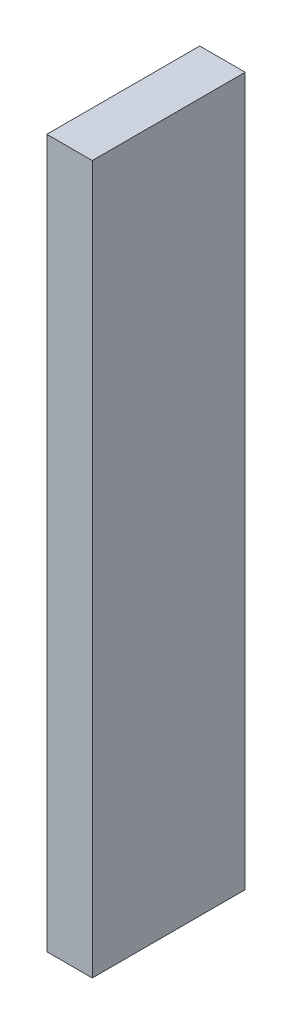
ISO-10303-21;
HEADER;
FILE_DESCRIPTION(('STEP AP214'),'2;1');
FILE_NAME('part.step','',(''),(''),'','','');
FILE_SCHEMA(('AUTOMOTIVE_DESIGN { 1 0 10303 214 1 1 1 1 }'));
ENDSEC;
DATA;
#1=APPLICATION_CONTEXT('core data for automotive mechanical design processes');
#2=APPLICATION_PROTOCOL_DEFINITION('international standard','automotive_design',2000,#1);
#3=PRODUCT_CONTEXT('',#1,'mechanical');
#4=PRODUCT('Part','Part','',(#3));
#5=PRODUCT_RELATED_PRODUCT_CATEGORY('part','',(#4));
#6=PRODUCT_DEFINITION_FORMATION('','',#4);
#7=PRODUCT_DEFINITION_CONTEXT('part definition',#1,'design');
#8=PRODUCT_DEFINITION('design','',#6,#7);
#9=PRODUCT_DEFINITION_SHAPE('','',#8);
#10=(LENGTH_UNIT() NAMED_UNIT(*) SI_UNIT(.MILLI.,.METRE.));
#11=(NAMED_UNIT(*) PLANE_ANGLE_UNIT() SI_UNIT($,.RADIAN.));
#12=(NAMED_UNIT(*) SI_UNIT($,.STERADIAN.) SOLID_ANGLE_UNIT());
#13=UNCERTAINTY_MEASURE_WITH_UNIT(LENGTH_MEASURE(1.E-05),#10,'distance_accuracy_value','');
#14=(GEOMETRIC_REPRESENTATION_CONTEXT(3) GLOBAL_UNCERTAINTY_ASSIGNED_CONTEXT((#13)) GLOBAL_UNIT_ASSIGNED_CONTEXT((#10,
#11,#12)) REPRESENTATION_CONTEXT('',''));
#15=CARTESIAN_POINT('',(0.,0.,0.));
#16=DIRECTION('',(0.,0.,1.));
#17=DIRECTION('',(1.,0.,0.));
#18=AXIS2_PLACEMENT_3D('',#15,#16,#17);
#19=CARTESIAN_POINT('',(130.275545204017,22.4180708263693,91.0720282028969));
#20=DIRECTION('',(-1.69244514382854E-09,0.,1.));
#21=DIRECTION('',(1.,0.,1.69244514382854E-09));
#22=AXIS2_PLACEMENT_3D('',#19,#20,#21);
#23=PLANE('',#22);
#24=DIRECTION('',(0.,-1.,0.));
#25=VECTOR('',#24,1.);
#26=CARTESIAN_POINT('',(131.25863030103,22.4180708263693,91.0720282045608));
#27=LINE('',#26,#25);
#28=CARTESIAN_POINT('',(131.25863030103,22.4180708263693,91.0720282045608));
#29=VERTEX_POINT('',#28);
#30=CARTESIAN_POINT('',(131.25863030103,7.11212965552236,91.0720282045608));
#31=VERTEX_POINT('',#30);
#32=EDGE_CURVE('E79',#29,#31,#27,.T.);
#33=ORIENTED_EDGE('',*,*,#32,.F.);
#34=DIRECTION('',(1.,0.,1.69244514382854E-09));
#35=VECTOR('',#34,1.);
#36=CARTESIAN_POINT('',(130.275545204017,22.4180708263693,91.0720282028969));
#37=LINE('',#36,#35);
#38=CARTESIAN_POINT('',(130.275545204017,22.4180708263693,91.0720282028969));
#39=VERTEX_POINT('',#38);
#40=EDGE_CURVE('E32',#39,#29,#37,.T.);
#41=ORIENTED_EDGE('',*,*,#40,.F.);
#42=DIRECTION('',(0.,-1.,0.));
#43=VECTOR('',#42,1.);
#44=CARTESIAN_POINT('',(130.275545204017,22.4180708263693,91.0720282028969));
#45=LINE('',#44,#43);
#46=CARTESIAN_POINT('',(130.275545204017,7.11212965552236,91.0720282028969));
#47=VERTEX_POINT('',#46);
#48=EDGE_CURVE('E71',#39,#47,#45,.T.);
#49=ORIENTED_EDGE('',*,*,#48,.T.);
#50=DIRECTION('',(1.,0.,1.69244514382854E-09));
#51=VECTOR('',#50,1.);
#52=CARTESIAN_POINT('',(130.275545204017,7.11212965552236,91.0720282028969));
#53=LINE('',#52,#51);
#54=EDGE_CURVE('E10',#47,#31,#53,.T.);
#55=ORIENTED_EDGE('',*,*,#54,.T.);
#56=EDGE_LOOP('',(#33,#41,#49,#55));
#57=FACE_BOUND('',#56,.T.);
#58=ADVANCED_FACE('F16',(#57),#23,.T.);
#59=CARTESIAN_POINT('',(130.275545204017,7.11212965552236,91.0720282028969));
#60=DIRECTION('',(0.,-1.,0.));
#61=DIRECTION('',(0.,0.,-1.));
#62=AXIS2_PLACEMENT_3D('',#59,#60,#61);
#63=PLANE('',#62);
#64=DIRECTION('',(1.69244514382854E-09,0.,-1.));
#65=VECTOR('',#64,1.);
#66=CARTESIAN_POINT('',(131.25863030103,7.11212965552236,91.0720282045608));
#67=LINE('',#66,#65);
#68=CARTESIAN_POINT('',(131.258630306625,7.11212965552235,87.766087033712));
#69=VERTEX_POINT('',#68);
#70=EDGE_CURVE('E82',#31,#69,#67,.T.);
#71=ORIENTED_EDGE('',*,*,#70,.F.);
#72=ORIENTED_EDGE('',*,*,#54,.F.);
#73=DIRECTION('',(1.69244514382854E-09,0.,-1.));
#74=VECTOR('',#73,1.);
#75=CARTESIAN_POINT('',(130.275545204017,7.11212965552236,91.0720282028969));
#76=LINE('',#75,#74);
#77=CARTESIAN_POINT('',(130.275545209612,7.11212965552235,87.7660870320482));
#78=VERTEX_POINT('',#77);
#79=EDGE_CURVE('E67',#47,#78,#76,.T.);
#80=ORIENTED_EDGE('',*,*,#79,.T.);
#81=DIRECTION('',(1.,0.,1.69244514382854E-09));
#82=VECTOR('',#81,1.);
#83=CARTESIAN_POINT('',(130.275545209612,7.11212965552235,87.7660870320482));
#84=LINE('',#83,#82);
#85=EDGE_CURVE('E24',#78,#69,#84,.T.);
#86=ORIENTED_EDGE('',*,*,#85,.T.);
#87=EDGE_LOOP('',(#71,#72,#80,#86));
#88=FACE_BOUND('',#87,.T.);
#89=ADVANCED_FACE('F68',(#88),#63,.T.);
#90=CARTESIAN_POINT('',(130.275545209612,7.11212965552235,87.7660870320482));
#91=DIRECTION('',(1.69244514382854E-09,0.,-1.));
#92=DIRECTION('',(-1.,0.,-1.69244514382854E-09));
#93=AXIS2_PLACEMENT_3D('',#90,#91,#92);
#94=PLANE('',#93);
#95=DIRECTION('',(0.,1.,0.));
#96=VECTOR('',#95,1.);
#97=CARTESIAN_POINT('',(131.258630306625,7.11212965552235,87.766087033712));
#98=LINE('',#97,#96);
#99=CARTESIAN_POINT('',(131.258630306625,22.418070826371,87.7660870252515));
#100=VERTEX_POINT('',#99);
#101=EDGE_CURVE('E65',#69,#100,#98,.T.);
#102=ORIENTED_EDGE('',*,*,#101,.F.);
#103=ORIENTED_EDGE('',*,*,#85,.F.);
#104=DIRECTION('',(0.,1.,0.));
#105=VECTOR('',#104,1.);
#106=CARTESIAN_POINT('',(130.275545209612,7.11212965552235,87.7660870320482));
#107=LINE('',#106,#105);
#108=CARTESIAN_POINT('',(130.275545209612,22.418070826371,87.7660870235877));
#109=VERTEX_POINT('',#108);
#110=EDGE_CURVE('E62',#78,#109,#107,.T.);
#111=ORIENTED_EDGE('',*,*,#110,.T.);
#112=DIRECTION('',(1.,0.,1.69244514382854E-09));
#113=VECTOR('',#112,1.);
#114=CARTESIAN_POINT('',(130.275545209612,22.418070826371,87.7660870235877));
#115=LINE('',#114,#113);
#116=EDGE_CURVE('E48',#109,#100,#115,.T.);
#117=ORIENTED_EDGE('',*,*,#116,.T.);
#118=EDGE_LOOP('',(#102,#103,#111,#117));
#119=FACE_BOUND('',#118,.T.);
#120=ADVANCED_FACE('F60',(#119),#94,.T.);
#121=CARTESIAN_POINT('',(130.275545209612,22.418070826371,87.7660870235877));
#122=DIRECTION('',(0.,1.,0.));
#123=DIRECTION('',(-1.,0.,0.));
#124=AXIS2_PLACEMENT_3D('',#121,#122,#123);
#125=PLANE('',#124);
#126=DIRECTION('',(-1.69244514382854E-09,0.,1.));
#127=VECTOR('',#126,1.);
#128=CARTESIAN_POINT('',(131.258630306625,22.418070826371,87.7660870252515));
#129=LINE('',#128,#127);
#130=EDGE_CURVE('E85',#100,#29,#129,.T.);
#131=ORIENTED_EDGE('',*,*,#130,.F.);
#132=ORIENTED_EDGE('',*,*,#116,.F.);
#133=DIRECTION('',(-1.69244514382854E-09,0.,1.));
#134=VECTOR('',#133,1.);
#135=CARTESIAN_POINT('',(130.275545209612,22.418070826371,87.7660870235877));
#136=LINE('',#135,#134);
#137=EDGE_CURVE('E74',#109,#39,#136,.T.);
#138=ORIENTED_EDGE('',*,*,#137,.T.);
#139=ORIENTED_EDGE('',*,*,#40,.T.);
#140=EDGE_LOOP('',(#131,#132,#138,#139));
#141=FACE_BOUND('',#140,.T.);
#142=ADVANCED_FACE('F96',(#141),#125,.T.);
#143=CARTESIAN_POINT('',(130.275545201028,17.2651002409467,92.8378644340291));
#144=DIRECTION('',(1.,0.,1.69244514382854E-09));
#145=DIRECTION('',(0.,1.,0.));
#146=AXIS2_PLACEMENT_3D('',#143,#144,#145);
#147=PLANE('',#146);
#148=ORIENTED_EDGE('',*,*,#48,.F.);
#149=ORIENTED_EDGE('',*,*,#137,.F.);
#150=ORIENTED_EDGE('',*,*,#110,.F.);
#151=ORIENTED_EDGE('',*,*,#79,.F.);
#152=EDGE_LOOP('',(#148,#149,#150,#151));
#153=FACE_BOUND('',#152,.T.);
#154=ADVANCED_FACE('F73',(#153),#147,.F.);
#155=CARTESIAN_POINT('',(131.258630298041,17.2651002409467,92.8378644356929));
#156=DIRECTION('',(1.,0.,1.69244514382854E-09));
#157=DIRECTION('',(0.,1.,0.));
#158=AXIS2_PLACEMENT_3D('',#155,#156,#157);
#159=PLANE('',#158);
#160=ORIENTED_EDGE('',*,*,#32,.T.);
#161=ORIENTED_EDGE('',*,*,#70,.T.);
#162=ORIENTED_EDGE('',*,*,#101,.T.);
#163=ORIENTED_EDGE('',*,*,#130,.T.);
#164=EDGE_LOOP('',(#160,#161,#162,#163));
#165=FACE_BOUND('',#164,.T.);
#166=ADVANCED_FACE('F89',(#165),#159,.T.);
#167=CLOSED_SHELL('',(#58,#89,#120,#142,#154,#166));
#168=MANIFOLD_SOLID_BREP('B1',#167);
#169=ADVANCED_BREP_SHAPE_REPRESENTATION('',(#18,#168),#14);
#170=SHAPE_DEFINITION_REPRESENTATION(#9,#169);
ENDSEC;
END-ISO-10303-21;
